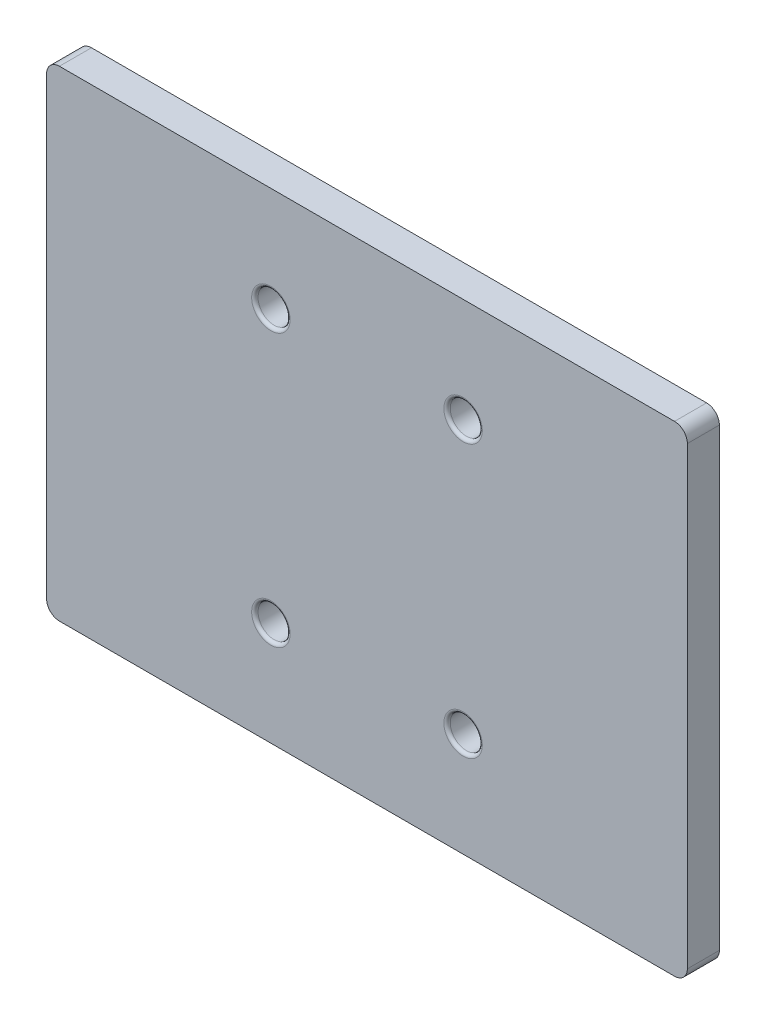
ISO-10303-21;
HEADER;
FILE_DESCRIPTION(('STEP AP214'),'2;1');
FILE_NAME('part.step','',(''),(''),'','','');
FILE_SCHEMA(('AUTOMOTIVE_DESIGN { 1 0 10303 214 1 1 1 1 }'));
ENDSEC;
DATA;
#1=APPLICATION_CONTEXT('core data for automotive mechanical design processes');
#2=APPLICATION_PROTOCOL_DEFINITION('international standard','automotive_design',2000,#1);
#3=PRODUCT_CONTEXT('',#1,'mechanical');
#4=PRODUCT('Part','Part','',(#3));
#5=PRODUCT_RELATED_PRODUCT_CATEGORY('part','',(#4));
#6=PRODUCT_DEFINITION_FORMATION('','',#4);
#7=PRODUCT_DEFINITION_CONTEXT('part definition',#1,'design');
#8=PRODUCT_DEFINITION('design','',#6,#7);
#9=PRODUCT_DEFINITION_SHAPE('','',#8);
#10=(LENGTH_UNIT() NAMED_UNIT(*) SI_UNIT(.MILLI.,.METRE.));
#11=(NAMED_UNIT(*) PLANE_ANGLE_UNIT() SI_UNIT($,.RADIAN.));
#12=(NAMED_UNIT(*) SI_UNIT($,.STERADIAN.) SOLID_ANGLE_UNIT());
#13=UNCERTAINTY_MEASURE_WITH_UNIT(LENGTH_MEASURE(1.E-05),#10,'distance_accuracy_value','');
#14=(GEOMETRIC_REPRESENTATION_CONTEXT(3) GLOBAL_UNCERTAINTY_ASSIGNED_CONTEXT((#13)) GLOBAL_UNIT_ASSIGNED_CONTEXT((#10,
#11,#12)) REPRESENTATION_CONTEXT('',''));
#15=CARTESIAN_POINT('',(0.,0.,0.));
#16=DIRECTION('',(0.,0.,1.));
#17=DIRECTION('',(1.,0.,0.));
#18=AXIS2_PLACEMENT_3D('',#15,#16,#17);
#19=CARTESIAN_POINT('',(250.,6.11266741651055E-13,1862.));
#20=DIRECTION('',(-1.,0.,0.));
#21=DIRECTION('',(0.,0.,-1.));
#22=AXIS2_PLACEMENT_3D('',#19,#20,#21);
#23=PLANE('',#22);
#24=DIRECTION('',(0.,1.,0.));
#25=VECTOR('',#24,1.);
#26=CARTESIAN_POINT('',(250.,6.11266741651055E-13,1867.));
#27=LINE('',#26,#25);
#28=CARTESIAN_POINT('',(250.,86.9999999999996,1867.));
#29=VERTEX_POINT('',#28);
#30=CARTESIAN_POINT('',(250.,157.999999999999,1867.));
#31=VERTEX_POINT('',#30);
#32=EDGE_CURVE('E141',#29,#31,#27,.T.);
#33=ORIENTED_EDGE('',*,*,#32,.F.);
#34=DIRECTION('',(0.,0.,1.));
#35=VECTOR('',#34,1.);
#36=CARTESIAN_POINT('',(250.,86.9999999999996,1862.));
#37=LINE('',#36,#35);
#38=CARTESIAN_POINT('',(250.,86.9999999999996,1862.));
#39=VERTEX_POINT('',#38);
#40=EDGE_CURVE('E175',#29,#39,#37,.F.);
#41=ORIENTED_EDGE('',*,*,#40,.T.);
#42=DIRECTION('',(0.,1.,0.));
#43=VECTOR('',#42,1.);
#44=CARTESIAN_POINT('',(250.,6.11266741651055E-13,1862.));
#45=LINE('',#44,#43);
#46=CARTESIAN_POINT('',(250.,157.999999999999,1862.));
#47=VERTEX_POINT('',#46);
#48=EDGE_CURVE('E139',#39,#47,#45,.T.);
#49=ORIENTED_EDGE('',*,*,#48,.T.);
#50=DIRECTION('',(0.,0.,1.));
#51=VECTOR('',#50,1.);
#52=CARTESIAN_POINT('',(250.,157.999999999999,1862.));
#53=LINE('',#52,#51);
#54=EDGE_CURVE('E171',#47,#31,#53,.T.);
#55=ORIENTED_EDGE('',*,*,#54,.T.);
#56=EDGE_LOOP('',(#33,#41,#49,#55));
#57=FACE_BOUND('',#56,.T.);
#58=ADVANCED_FACE('F38',(#57),#23,.F.);
#59=CARTESIAN_POINT('',(215.,159.999999999999,1862.));
#60=DIRECTION('',(0.,-1.,0.));
#61=DIRECTION('',(0.,0.,1.));
#62=AXIS2_PLACEMENT_3D('',#59,#60,#61);
#63=PLANE('',#62);
#64=DIRECTION('',(-1.,0.,0.));
#65=VECTOR('',#64,1.);
#66=CARTESIAN_POINT('',(215.,159.999999999999,1867.));
#67=LINE('',#66,#65);
#68=CARTESIAN_POINT('',(248.,159.999999999999,1867.));
#69=VERTEX_POINT('',#68);
#70=CARTESIAN_POINT('',(152.,159.999999999999,1867.));
#71=VERTEX_POINT('',#70);
#72=EDGE_CURVE('E135',#69,#71,#67,.T.);
#73=ORIENTED_EDGE('',*,*,#72,.F.);
#74=DIRECTION('',(0.,0.,1.));
#75=VECTOR('',#74,1.);
#76=CARTESIAN_POINT('',(248.,159.999999999999,1862.));
#77=LINE('',#76,#75);
#78=CARTESIAN_POINT('',(248.,159.999999999999,1862.));
#79=VERTEX_POINT('',#78);
#80=EDGE_CURVE('E61',#69,#79,#77,.F.);
#81=ORIENTED_EDGE('',*,*,#80,.T.);
#82=DIRECTION('',(-1.,0.,0.));
#83=VECTOR('',#82,1.);
#84=CARTESIAN_POINT('',(215.,159.999999999999,1862.));
#85=LINE('',#84,#83);
#86=CARTESIAN_POINT('',(152.,159.999999999999,1862.));
#87=VERTEX_POINT('',#86);
#88=EDGE_CURVE('E511',#79,#87,#85,.T.);
#89=ORIENTED_EDGE('',*,*,#88,.T.);
#90=DIRECTION('',(0.,0.,1.));
#91=VECTOR('',#90,1.);
#92=CARTESIAN_POINT('',(152.,159.999999999999,1867.));
#93=LINE('',#92,#91);
#94=EDGE_CURVE('E178',#87,#71,#93,.T.);
#95=ORIENTED_EDGE('',*,*,#94,.T.);
#96=EDGE_LOOP('',(#73,#81,#89,#95));
#97=FACE_BOUND('',#96,.T.);
#98=ADVANCED_FACE('F261',(#97),#63,.F.);
#99=CARTESIAN_POINT('',(150.,6.11266741651055E-13,1862.));
#100=DIRECTION('',(-1.,0.,0.));
#101=DIRECTION('',(0.,0.,-1.));
#102=AXIS2_PLACEMENT_3D('',#99,#100,#101);
#103=PLANE('',#102);
#104=DIRECTION('',(0.,1.,0.));
#105=VECTOR('',#104,1.);
#106=CARTESIAN_POINT('',(150.,6.11266741651055E-13,1862.));
#107=LINE('',#106,#105);
#108=CARTESIAN_POINT('',(150.,86.9999999999996,1862.));
#109=VERTEX_POINT('',#108);
#110=CARTESIAN_POINT('',(150.,157.999999999999,1862.));
#111=VERTEX_POINT('',#110);
#112=EDGE_CURVE('E126',#109,#111,#107,.T.);
#113=ORIENTED_EDGE('',*,*,#112,.F.);
#114=DIRECTION('',(0.,0.,1.));
#115=VECTOR('',#114,1.);
#116=CARTESIAN_POINT('',(150.,86.9999999999996,1862.));
#117=LINE('',#116,#115);
#118=CARTESIAN_POINT('',(150.,86.9999999999996,1867.));
#119=VERTEX_POINT('',#118);
#120=EDGE_CURVE('E110',#109,#119,#117,.T.);
#121=ORIENTED_EDGE('',*,*,#120,.T.);
#122=DIRECTION('',(0.,1.,0.));
#123=VECTOR('',#122,1.);
#124=CARTESIAN_POINT('',(150.,6.11266741651055E-13,1867.));
#125=LINE('',#124,#123);
#126=CARTESIAN_POINT('',(150.,157.999999999999,1867.));
#127=VERTEX_POINT('',#126);
#128=EDGE_CURVE('E124',#119,#127,#125,.T.);
#129=ORIENTED_EDGE('',*,*,#128,.T.);
#130=DIRECTION('',(0.,0.,1.));
#131=VECTOR('',#130,1.);
#132=CARTESIAN_POINT('',(150.,157.999999999999,1862.));
#133=LINE('',#132,#131);
#134=EDGE_CURVE('E129',#127,#111,#133,.F.);
#135=ORIENTED_EDGE('',*,*,#134,.T.);
#136=EDGE_LOOP('',(#113,#121,#129,#135));
#137=FACE_BOUND('',#136,.T.);
#138=ADVANCED_FACE('F123',(#137),#103,.T.);
#139=CARTESIAN_POINT('',(215.,84.9999999999996,1862.));
#140=DIRECTION('',(0.,-1.,0.));
#141=DIRECTION('',(0.,0.,1.));
#142=AXIS2_PLACEMENT_3D('',#139,#140,#141);
#143=PLANE('',#142);
#144=DIRECTION('',(-1.,0.,0.));
#145=VECTOR('',#144,1.);
#146=CARTESIAN_POINT('',(215.,84.9999999999996,1867.));
#147=LINE('',#146,#145);
#148=CARTESIAN_POINT('',(248.,84.9999999999996,1867.));
#149=VERTEX_POINT('',#148);
#150=CARTESIAN_POINT('',(152.,84.9999999999996,1867.));
#151=VERTEX_POINT('',#150);
#152=EDGE_CURVE('E134',#149,#151,#147,.T.);
#153=ORIENTED_EDGE('',*,*,#152,.T.);
#154=DIRECTION('',(0.,0.,1.));
#155=VECTOR('',#154,1.);
#156=CARTESIAN_POINT('',(152.,84.9999999999996,1862.));
#157=LINE('',#156,#155);
#158=CARTESIAN_POINT('',(152.,84.9999999999996,1862.));
#159=VERTEX_POINT('',#158);
#160=EDGE_CURVE('E111',#151,#159,#157,.F.);
#161=ORIENTED_EDGE('',*,*,#160,.T.);
#162=DIRECTION('',(-1.,0.,0.));
#163=VECTOR('',#162,1.);
#164=CARTESIAN_POINT('',(215.,84.9999999999996,1862.));
#165=LINE('',#164,#163);
#166=CARTESIAN_POINT('',(248.,84.9999999999996,1862.));
#167=VERTEX_POINT('',#166);
#168=EDGE_CURVE('E146',#167,#159,#165,.T.);
#169=ORIENTED_EDGE('',*,*,#168,.F.);
#170=DIRECTION('',(0.,0.,1.));
#171=VECTOR('',#170,1.);
#172=CARTESIAN_POINT('',(248.,84.9999999999996,1867.));
#173=LINE('',#172,#171);
#174=EDGE_CURVE('E117',#167,#149,#173,.T.);
#175=ORIENTED_EDGE('',*,*,#174,.T.);
#176=EDGE_LOOP('',(#153,#161,#169,#175));
#177=FACE_BOUND('',#176,.T.);
#178=ADVANCED_FACE('F321',(#177),#143,.T.);
#179=CARTESIAN_POINT('',(0.,0.,1862.));
#180=DIRECTION('',(0.,0.,-1.));
#181=DIRECTION('',(1.,0.,0.));
#182=AXIS2_PLACEMENT_3D('',#179,#180,#181);
#183=PLANE('',#182);
#184=CARTESIAN_POINT('',(185.,143.749999999999,1862.));
#185=DIRECTION('',(0.,0.,-1.));
#186=DIRECTION('',(-1.,0.,0.));
#187=AXIS2_PLACEMENT_3D('',#184,#185,#186);
#188=CIRCLE('',#187,3.00000000000003);
#189=CARTESIAN_POINT('',(182.,143.749999999999,1862.));
#190=VERTEX_POINT('',#189);
#191=EDGE_CURVE('E204',#190,#190,#188,.F.);
#192=ORIENTED_EDGE('',*,*,#191,.T.);
#193=EDGE_LOOP('',(#192));
#194=FACE_BOUND('',#193,.T.);
#195=CARTESIAN_POINT('',(185.,101.249999999999,1862.));
#196=DIRECTION('',(0.,0.,-1.));
#197=DIRECTION('',(-1.,0.,0.));
#198=AXIS2_PLACEMENT_3D('',#195,#196,#197);
#199=CIRCLE('',#198,3.00000000000003);
#200=CARTESIAN_POINT('',(182.,101.249999999999,1862.));
#201=VERTEX_POINT('',#200);
#202=EDGE_CURVE('E200',#201,#201,#199,.F.);
#203=ORIENTED_EDGE('',*,*,#202,.T.);
#204=EDGE_LOOP('',(#203));
#205=FACE_BOUND('',#204,.T.);
#206=CARTESIAN_POINT('',(215.,101.249999999999,1862.));
#207=DIRECTION('',(0.,0.,-1.));
#208=DIRECTION('',(-1.,0.,0.));
#209=AXIS2_PLACEMENT_3D('',#206,#207,#208);
#210=CIRCLE('',#209,3.00000000000003);
#211=CARTESIAN_POINT('',(212.,101.249999999999,1862.));
#212=VERTEX_POINT('',#211);
#213=EDGE_CURVE('E196',#212,#212,#210,.F.);
#214=ORIENTED_EDGE('',*,*,#213,.T.);
#215=EDGE_LOOP('',(#214));
#216=FACE_BOUND('',#215,.T.);
#217=CARTESIAN_POINT('',(215.,143.749999999999,1862.));
#218=DIRECTION('',(0.,0.,-1.));
#219=DIRECTION('',(-1.,0.,0.));
#220=AXIS2_PLACEMENT_3D('',#217,#218,#219);
#221=CIRCLE('',#220,3.00000000000003);
#222=CARTESIAN_POINT('',(212.,143.749999999999,1862.));
#223=VERTEX_POINT('',#222);
#224=EDGE_CURVE('E192',#223,#223,#221,.F.);
#225=ORIENTED_EDGE('',*,*,#224,.T.);
#226=EDGE_LOOP('',(#225));
#227=FACE_BOUND('',#226,.T.);
#228=ORIENTED_EDGE('',*,*,#168,.T.);
#229=CARTESIAN_POINT('',(152.,86.9999999999996,1862.));
#230=DIRECTION('',(0.,0.,-1.));
#231=DIRECTION('',(-1.,0.,0.));
#232=AXIS2_PLACEMENT_3D('',#229,#230,#231);
#233=CIRCLE('',#232,2.);
#234=EDGE_CURVE('E168',#159,#109,#233,.T.);
#235=ORIENTED_EDGE('',*,*,#234,.T.);
#236=ORIENTED_EDGE('',*,*,#112,.T.);
#237=CARTESIAN_POINT('',(152.,157.999999999999,1862.));
#238=DIRECTION('',(0.,0.,-1.));
#239=DIRECTION('',(-1.,0.,0.));
#240=AXIS2_PLACEMENT_3D('',#237,#238,#239);
#241=CIRCLE('',#240,2.);
#242=EDGE_CURVE('E54',#111,#87,#241,.T.);
#243=ORIENTED_EDGE('',*,*,#242,.T.);
#244=ORIENTED_EDGE('',*,*,#88,.F.);
#245=CARTESIAN_POINT('',(248.,157.999999999999,1862.));
#246=DIRECTION('',(0.,0.,-1.));
#247=DIRECTION('',(-1.,0.,0.));
#248=AXIS2_PLACEMENT_3D('',#245,#246,#247);
#249=CIRCLE('',#248,2.);
#250=EDGE_CURVE('E162',#79,#47,#249,.T.);
#251=ORIENTED_EDGE('',*,*,#250,.T.);
#252=ORIENTED_EDGE('',*,*,#48,.F.);
#253=CARTESIAN_POINT('',(248.,86.9999999999996,1862.));
#254=DIRECTION('',(0.,0.,-1.));
#255=DIRECTION('',(-1.,0.,0.));
#256=AXIS2_PLACEMENT_3D('',#253,#254,#255);
#257=CIRCLE('',#256,2.);
#258=EDGE_CURVE('E165',#39,#167,#257,.T.);
#259=ORIENTED_EDGE('',*,*,#258,.T.);
#260=EDGE_LOOP('',(#228,#235,#236,#243,#244,#251,#252,#259));
#261=FACE_BOUND('',#260,.T.);
#262=ADVANCED_FACE('F316',(#194,#205,#216,#227,#261),#183,.T.);
#263=CARTESIAN_POINT('',(0.,0.,1867.));
#264=DIRECTION('',(0.,0.,-1.));
#265=DIRECTION('',(1.,0.,0.));
#266=AXIS2_PLACEMENT_3D('',#263,#264,#265);
#267=PLANE('',#266);
#268=CARTESIAN_POINT('',(215.,143.749999999999,1867.));
#269=DIRECTION('',(0.,0.,-1.));
#270=DIRECTION('',(-1.,0.,0.));
#271=AXIS2_PLACEMENT_3D('',#268,#269,#270);
#272=CIRCLE('',#271,3.00000000000003);
#273=CARTESIAN_POINT('',(212.,143.749999999999,1867.));
#274=VERTEX_POINT('',#273);
#275=EDGE_CURVE('E11',#274,#274,#272,.T.);
#276=ORIENTED_EDGE('',*,*,#275,.T.);
#277=EDGE_LOOP('',(#276));
#278=FACE_BOUND('',#277,.T.);
#279=CARTESIAN_POINT('',(185.,101.249999999999,1867.));
#280=DIRECTION('',(0.,0.,-1.));
#281=DIRECTION('',(-1.,0.,0.));
#282=AXIS2_PLACEMENT_3D('',#279,#280,#281);
#283=CIRCLE('',#282,3.00000000000003);
#284=CARTESIAN_POINT('',(182.,101.249999999999,1867.));
#285=VERTEX_POINT('',#284);
#286=EDGE_CURVE('E47',#285,#285,#283,.T.);
#287=ORIENTED_EDGE('',*,*,#286,.T.);
#288=EDGE_LOOP('',(#287));
#289=FACE_BOUND('',#288,.T.);
#290=CARTESIAN_POINT('',(215.,101.249999999999,1867.));
#291=DIRECTION('',(0.,0.,-1.));
#292=DIRECTION('',(-1.,0.,0.));
#293=AXIS2_PLACEMENT_3D('',#290,#291,#292);
#294=CIRCLE('',#293,3.00000000000003);
#295=CARTESIAN_POINT('',(212.,101.249999999999,1867.));
#296=VERTEX_POINT('',#295);
#297=EDGE_CURVE('E236',#296,#296,#294,.T.);
#298=ORIENTED_EDGE('',*,*,#297,.T.);
#299=EDGE_LOOP('',(#298));
#300=FACE_BOUND('',#299,.T.);
#301=CARTESIAN_POINT('',(185.,143.749999999999,1867.));
#302=DIRECTION('',(0.,0.,-1.));
#303=DIRECTION('',(-1.,0.,0.));
#304=AXIS2_PLACEMENT_3D('',#301,#302,#303);
#305=CIRCLE('',#304,3.00000000000003);
#306=CARTESIAN_POINT('',(182.,143.749999999999,1867.));
#307=VERTEX_POINT('',#306);
#308=EDGE_CURVE('E232',#307,#307,#305,.T.);
#309=ORIENTED_EDGE('',*,*,#308,.T.);
#310=EDGE_LOOP('',(#309));
#311=FACE_BOUND('',#310,.T.);
#312=ORIENTED_EDGE('',*,*,#128,.F.);
#313=CARTESIAN_POINT('',(152.,86.9999999999996,1867.));
#314=DIRECTION('',(0.,0.,-1.));
#315=DIRECTION('',(-1.,0.,0.));
#316=AXIS2_PLACEMENT_3D('',#313,#314,#315);
#317=CIRCLE('',#316,2.);
#318=EDGE_CURVE('E106',#119,#151,#317,.F.);
#319=ORIENTED_EDGE('',*,*,#318,.T.);
#320=ORIENTED_EDGE('',*,*,#152,.F.);
#321=CARTESIAN_POINT('',(248.,86.9999999999996,1867.));
#322=DIRECTION('',(0.,0.,-1.));
#323=DIRECTION('',(-1.,0.,0.));
#324=AXIS2_PLACEMENT_3D('',#321,#322,#323);
#325=CIRCLE('',#324,2.);
#326=EDGE_CURVE('E118',#149,#29,#325,.F.);
#327=ORIENTED_EDGE('',*,*,#326,.T.);
#328=ORIENTED_EDGE('',*,*,#32,.T.);
#329=CARTESIAN_POINT('',(248.,157.999999999999,1867.));
#330=DIRECTION('',(0.,0.,-1.));
#331=DIRECTION('',(-1.,0.,0.));
#332=AXIS2_PLACEMENT_3D('',#329,#330,#331);
#333=CIRCLE('',#332,2.);
#334=EDGE_CURVE('E150',#31,#69,#333,.F.);
#335=ORIENTED_EDGE('',*,*,#334,.T.);
#336=ORIENTED_EDGE('',*,*,#72,.T.);
#337=CARTESIAN_POINT('',(152.,157.999999999999,1867.));
#338=DIRECTION('',(0.,0.,-1.));
#339=DIRECTION('',(-1.,0.,0.));
#340=AXIS2_PLACEMENT_3D('',#337,#338,#339);
#341=CIRCLE('',#340,2.);
#342=EDGE_CURVE('E128',#71,#127,#341,.F.);
#343=ORIENTED_EDGE('',*,*,#342,.T.);
#344=EDGE_LOOP('',(#312,#319,#320,#327,#328,#335,#336,#343));
#345=FACE_BOUND('',#344,.T.);
#346=ADVANCED_FACE('F131',(#278,#289,#300,#311,#345),#267,.F.);
#347=CARTESIAN_POINT('',(215.,143.749999999999,1862.));
#348=DIRECTION('',(0.,0.,1.));
#349=DIRECTION('',(-1.,0.,0.));
#350=AXIS2_PLACEMENT_3D('',#347,#348,#349);
#351=CYLINDRICAL_SURFACE('',#350,2.50000000000003);
#352=CARTESIAN_POINT('',(215.,143.749999999999,1862.5));
#353=DIRECTION('',(0.,0.,-1.));
#354=DIRECTION('',(-1.,0.,0.));
#355=AXIS2_PLACEMENT_3D('',#352,#353,#354);
#356=CIRCLE('',#355,2.50000000000003);
#357=CARTESIAN_POINT('',(212.5,143.749999999999,1862.5));
#358=VERTEX_POINT('',#357);
#359=EDGE_CURVE('E228',#358,#358,#356,.T.);
#360=ORIENTED_EDGE('',*,*,#359,.T.);
#361=EDGE_LOOP('',(#360));
#362=FACE_BOUND('',#361,.T.);
#363=CARTESIAN_POINT('',(215.,143.749999999999,1866.5));
#364=DIRECTION('',(0.,0.,-1.));
#365=DIRECTION('',(-1.,0.,0.));
#366=AXIS2_PLACEMENT_3D('',#363,#364,#365);
#367=CIRCLE('',#366,2.50000000000003);
#368=CARTESIAN_POINT('',(212.5,143.749999999999,1866.5));
#369=VERTEX_POINT('',#368);
#370=EDGE_CURVE('E224',#369,#369,#367,.F.);
#371=ORIENTED_EDGE('',*,*,#370,.T.);
#372=EDGE_LOOP('',(#371));
#373=FACE_BOUND('',#372,.T.);
#374=ADVANCED_FACE('F306',(#362,#373),#351,.F.);
#375=CARTESIAN_POINT('',(185.,143.749999999999,1862.));
#376=DIRECTION('',(0.,0.,1.));
#377=DIRECTION('',(-1.,0.,0.));
#378=AXIS2_PLACEMENT_3D('',#375,#376,#377);
#379=CYLINDRICAL_SURFACE('',#378,2.50000000000003);
#380=CARTESIAN_POINT('',(185.,143.749999999999,1862.5));
#381=DIRECTION('',(0.,0.,-1.));
#382=DIRECTION('',(-1.,0.,0.));
#383=AXIS2_PLACEMENT_3D('',#380,#381,#382);
#384=CIRCLE('',#383,2.50000000000003);
#385=CARTESIAN_POINT('',(182.5,143.749999999999,1862.5));
#386=VERTEX_POINT('',#385);
#387=EDGE_CURVE('E188',#386,#386,#384,.T.);
#388=ORIENTED_EDGE('',*,*,#387,.T.);
#389=EDGE_LOOP('',(#388));
#390=FACE_BOUND('',#389,.T.);
#391=CARTESIAN_POINT('',(185.,143.749999999999,1866.5));
#392=DIRECTION('',(0.,0.,-1.));
#393=DIRECTION('',(-1.,0.,0.));
#394=AXIS2_PLACEMENT_3D('',#391,#392,#393);
#395=CIRCLE('',#394,2.50000000000003);
#396=CARTESIAN_POINT('',(182.5,143.749999999999,1866.5));
#397=VERTEX_POINT('',#396);
#398=EDGE_CURVE('E184',#397,#397,#395,.F.);
#399=ORIENTED_EDGE('',*,*,#398,.T.);
#400=EDGE_LOOP('',(#399));
#401=FACE_BOUND('',#400,.T.);
#402=ADVANCED_FACE('F309',(#390,#401),#379,.F.);
#403=CARTESIAN_POINT('',(185.,101.249999999999,1862.));
#404=DIRECTION('',(0.,0.,1.));
#405=DIRECTION('',(-1.,0.,0.));
#406=AXIS2_PLACEMENT_3D('',#403,#404,#405);
#407=CYLINDRICAL_SURFACE('',#406,2.50000000000003);
#408=CARTESIAN_POINT('',(185.,101.249999999999,1862.5));
#409=DIRECTION('',(0.,0.,-1.));
#410=DIRECTION('',(-1.,0.,0.));
#411=AXIS2_PLACEMENT_3D('',#408,#409,#410);
#412=CIRCLE('',#411,2.50000000000003);
#413=CARTESIAN_POINT('',(182.5,101.249999999999,1862.5));
#414=VERTEX_POINT('',#413);
#415=EDGE_CURVE('E212',#414,#414,#412,.T.);
#416=ORIENTED_EDGE('',*,*,#415,.T.);
#417=EDGE_LOOP('',(#416));
#418=FACE_BOUND('',#417,.T.);
#419=CARTESIAN_POINT('',(185.,101.249999999999,1866.5));
#420=DIRECTION('',(0.,0.,-1.));
#421=DIRECTION('',(-1.,0.,0.));
#422=AXIS2_PLACEMENT_3D('',#419,#420,#421);
#423=CIRCLE('',#422,2.50000000000003);
#424=CARTESIAN_POINT('',(182.5,101.249999999999,1866.5));
#425=VERTEX_POINT('',#424);
#426=EDGE_CURVE('E208',#425,#425,#423,.F.);
#427=ORIENTED_EDGE('',*,*,#426,.T.);
#428=EDGE_LOOP('',(#427));
#429=FACE_BOUND('',#428,.T.);
#430=ADVANCED_FACE('F367',(#418,#429),#407,.F.);
#431=CARTESIAN_POINT('',(215.,101.249999999999,1862.));
#432=DIRECTION('',(0.,0.,1.));
#433=DIRECTION('',(-1.,0.,0.));
#434=AXIS2_PLACEMENT_3D('',#431,#432,#433);
#435=CYLINDRICAL_SURFACE('',#434,2.50000000000003);
#436=CARTESIAN_POINT('',(215.,101.249999999999,1862.5));
#437=DIRECTION('',(0.,0.,-1.));
#438=DIRECTION('',(-1.,0.,0.));
#439=AXIS2_PLACEMENT_3D('',#436,#437,#438);
#440=CIRCLE('',#439,2.50000000000003);
#441=CARTESIAN_POINT('',(212.5,101.249999999999,1862.5));
#442=VERTEX_POINT('',#441);
#443=EDGE_CURVE('E220',#442,#442,#440,.T.);
#444=ORIENTED_EDGE('',*,*,#443,.T.);
#445=EDGE_LOOP('',(#444));
#446=FACE_BOUND('',#445,.T.);
#447=CARTESIAN_POINT('',(215.,101.249999999999,1866.5));
#448=DIRECTION('',(0.,0.,-1.));
#449=DIRECTION('',(-1.,0.,0.));
#450=AXIS2_PLACEMENT_3D('',#447,#448,#449);
#451=CIRCLE('',#450,2.50000000000003);
#452=CARTESIAN_POINT('',(212.5,101.249999999999,1866.5));
#453=VERTEX_POINT('',#452);
#454=EDGE_CURVE('E216',#453,#453,#451,.F.);
#455=ORIENTED_EDGE('',*,*,#454,.T.);
#456=EDGE_LOOP('',(#455));
#457=FACE_BOUND('',#456,.T.);
#458=ADVANCED_FACE('F274',(#446,#457),#435,.F.);
#459=CARTESIAN_POINT('',(152.,86.9999999999996,1862.));
#460=DIRECTION('',(0.,0.,1.));
#461=DIRECTION('',(1.,0.,0.));
#462=AXIS2_PLACEMENT_3D('',#459,#460,#461);
#463=CYLINDRICAL_SURFACE('',#462,2.);
#464=ORIENTED_EDGE('',*,*,#234,.F.);
#465=ORIENTED_EDGE('',*,*,#160,.F.);
#466=ORIENTED_EDGE('',*,*,#318,.F.);
#467=ORIENTED_EDGE('',*,*,#120,.F.);
#468=EDGE_LOOP('',(#464,#465,#466,#467));
#469=FACE_BOUND('',#468,.T.);
#470=ADVANCED_FACE('F109',(#469),#463,.T.);
#471=CARTESIAN_POINT('',(248.,86.9999999999996,1862.));
#472=DIRECTION('',(0.,0.,-1.));
#473=DIRECTION('',(-1.,0.,0.));
#474=AXIS2_PLACEMENT_3D('',#471,#472,#473);
#475=CYLINDRICAL_SURFACE('',#474,2.);
#476=ORIENTED_EDGE('',*,*,#258,.F.);
#477=ORIENTED_EDGE('',*,*,#40,.F.);
#478=ORIENTED_EDGE('',*,*,#326,.F.);
#479=ORIENTED_EDGE('',*,*,#174,.F.);
#480=EDGE_LOOP('',(#476,#477,#478,#479));
#481=FACE_BOUND('',#480,.T.);
#482=ADVANCED_FACE('F273',(#481),#475,.T.);
#483=CARTESIAN_POINT('',(248.,157.999999999999,1862.));
#484=DIRECTION('',(0.,0.,1.));
#485=DIRECTION('',(1.,0.,0.));
#486=AXIS2_PLACEMENT_3D('',#483,#484,#485);
#487=CYLINDRICAL_SURFACE('',#486,2.);
#488=ORIENTED_EDGE('',*,*,#250,.F.);
#489=ORIENTED_EDGE('',*,*,#80,.F.);
#490=ORIENTED_EDGE('',*,*,#334,.F.);
#491=ORIENTED_EDGE('',*,*,#54,.F.);
#492=EDGE_LOOP('',(#488,#489,#490,#491));
#493=FACE_BOUND('',#492,.T.);
#494=ADVANCED_FACE('F277',(#493),#487,.T.);
#495=CARTESIAN_POINT('',(152.,157.999999999999,1862.));
#496=DIRECTION('',(0.,0.,-1.));
#497=DIRECTION('',(-1.,0.,0.));
#498=AXIS2_PLACEMENT_3D('',#495,#496,#497);
#499=CYLINDRICAL_SURFACE('',#498,2.);
#500=ORIENTED_EDGE('',*,*,#242,.F.);
#501=ORIENTED_EDGE('',*,*,#134,.F.);
#502=ORIENTED_EDGE('',*,*,#342,.F.);
#503=ORIENTED_EDGE('',*,*,#94,.F.);
#504=EDGE_LOOP('',(#500,#501,#502,#503));
#505=FACE_BOUND('',#504,.T.);
#506=ADVANCED_FACE('F281',(#505),#499,.T.);
#507=CARTESIAN_POINT('',(185.,143.749999999999,1862.5));
#508=DIRECTION('',(0.,0.,-1.));
#509=DIRECTION('',(-1.,0.,0.));
#510=AXIS2_PLACEMENT_3D('',#507,#508,#509);
#511=TOROIDAL_SURFACE('',#510,3.00000000000003,0.5);
#512=ORIENTED_EDGE('',*,*,#191,.F.);
#513=EDGE_LOOP('',(#512));
#514=FACE_BOUND('',#513,.T.);
#515=ORIENTED_EDGE('',*,*,#387,.F.);
#516=EDGE_LOOP('',(#515));
#517=FACE_BOUND('',#516,.T.);
#518=ADVANCED_FACE('F285',(#514,#517),#511,.T.);
#519=CARTESIAN_POINT('',(185.,101.249999999999,1862.5));
#520=DIRECTION('',(0.,0.,-1.));
#521=DIRECTION('',(-1.,0.,0.));
#522=AXIS2_PLACEMENT_3D('',#519,#520,#521);
#523=TOROIDAL_SURFACE('',#522,3.00000000000003,0.5);
#524=ORIENTED_EDGE('',*,*,#202,.F.);
#525=EDGE_LOOP('',(#524));
#526=FACE_BOUND('',#525,.T.);
#527=ORIENTED_EDGE('',*,*,#415,.F.);
#528=EDGE_LOOP('',(#527));
#529=FACE_BOUND('',#528,.T.);
#530=ADVANCED_FACE('F289',(#526,#529),#523,.T.);
#531=CARTESIAN_POINT('',(215.,101.249999999999,1862.5));
#532=DIRECTION('',(0.,0.,-1.));
#533=DIRECTION('',(-1.,0.,0.));
#534=AXIS2_PLACEMENT_3D('',#531,#532,#533);
#535=TOROIDAL_SURFACE('',#534,3.00000000000003,0.5);
#536=ORIENTED_EDGE('',*,*,#213,.F.);
#537=EDGE_LOOP('',(#536));
#538=FACE_BOUND('',#537,.T.);
#539=ORIENTED_EDGE('',*,*,#443,.F.);
#540=EDGE_LOOP('',(#539));
#541=FACE_BOUND('',#540,.T.);
#542=ADVANCED_FACE('F293',(#538,#541),#535,.T.);
#543=CARTESIAN_POINT('',(215.,143.749999999999,1862.5));
#544=DIRECTION('',(0.,0.,-1.));
#545=DIRECTION('',(-1.,0.,0.));
#546=AXIS2_PLACEMENT_3D('',#543,#544,#545);
#547=TOROIDAL_SURFACE('',#546,3.00000000000003,0.5);
#548=ORIENTED_EDGE('',*,*,#224,.F.);
#549=EDGE_LOOP('',(#548));
#550=FACE_BOUND('',#549,.T.);
#551=ORIENTED_EDGE('',*,*,#359,.F.);
#552=EDGE_LOOP('',(#551));
#553=FACE_BOUND('',#552,.T.);
#554=ADVANCED_FACE('F256',(#550,#553),#547,.T.);
#555=CARTESIAN_POINT('',(215.,143.749999999999,1866.5));
#556=DIRECTION('',(0.,0.,-1.));
#557=DIRECTION('',(-1.,0.,0.));
#558=AXIS2_PLACEMENT_3D('',#555,#556,#557);
#559=TOROIDAL_SURFACE('',#558,3.00000000000003,0.5);
#560=ORIENTED_EDGE('',*,*,#370,.F.);
#561=EDGE_LOOP('',(#560));
#562=FACE_BOUND('',#561,.T.);
#563=ORIENTED_EDGE('',*,*,#275,.F.);
#564=EDGE_LOOP('',(#563));
#565=FACE_BOUND('',#564,.T.);
#566=ADVANCED_FACE('F248',(#562,#565),#559,.T.);
#567=CARTESIAN_POINT('',(185.,101.249999999999,1866.5));
#568=DIRECTION('',(0.,0.,-1.));
#569=DIRECTION('',(-1.,0.,0.));
#570=AXIS2_PLACEMENT_3D('',#567,#568,#569);
#571=TOROIDAL_SURFACE('',#570,3.00000000000003,0.5);
#572=ORIENTED_EDGE('',*,*,#426,.F.);
#573=EDGE_LOOP('',(#572));
#574=FACE_BOUND('',#573,.T.);
#575=ORIENTED_EDGE('',*,*,#286,.F.);
#576=EDGE_LOOP('',(#575));
#577=FACE_BOUND('',#576,.T.);
#578=ADVANCED_FACE('F245',(#574,#577),#571,.T.);
#579=CARTESIAN_POINT('',(215.,101.249999999999,1866.5));
#580=DIRECTION('',(0.,0.,-1.));
#581=DIRECTION('',(-1.,0.,0.));
#582=AXIS2_PLACEMENT_3D('',#579,#580,#581);
#583=TOROIDAL_SURFACE('',#582,3.00000000000003,0.5);
#584=ORIENTED_EDGE('',*,*,#454,.F.);
#585=EDGE_LOOP('',(#584));
#586=FACE_BOUND('',#585,.T.);
#587=ORIENTED_EDGE('',*,*,#297,.F.);
#588=EDGE_LOOP('',(#587));
#589=FACE_BOUND('',#588,.T.);
#590=ADVANCED_FACE('F247',(#586,#589),#583,.T.);
#591=CARTESIAN_POINT('',(185.,143.749999999999,1866.5));
#592=DIRECTION('',(0.,0.,-1.));
#593=DIRECTION('',(-1.,0.,0.));
#594=AXIS2_PLACEMENT_3D('',#591,#592,#593);
#595=TOROIDAL_SURFACE('',#594,3.00000000000003,0.5);
#596=ORIENTED_EDGE('',*,*,#398,.F.);
#597=EDGE_LOOP('',(#596));
#598=FACE_BOUND('',#597,.T.);
#599=ORIENTED_EDGE('',*,*,#308,.F.);
#600=EDGE_LOOP('',(#599));
#601=FACE_BOUND('',#600,.T.);
#602=ADVANCED_FACE('F40',(#598,#601),#595,.T.);
#603=CLOSED_SHELL('',(#58,#98,#138,#178,#262,#346,#374,#402,#430,#458,#470,#482,#494,#506,#518,
#530,#542,#554,#566,#578,#590,#602));
#604=MANIFOLD_SOLID_BREP('B2',#603);
#605=ADVANCED_BREP_SHAPE_REPRESENTATION('',(#18,#604),#14);
#606=SHAPE_DEFINITION_REPRESENTATION(#9,#605);
ENDSEC;
END-ISO-10303-21;
